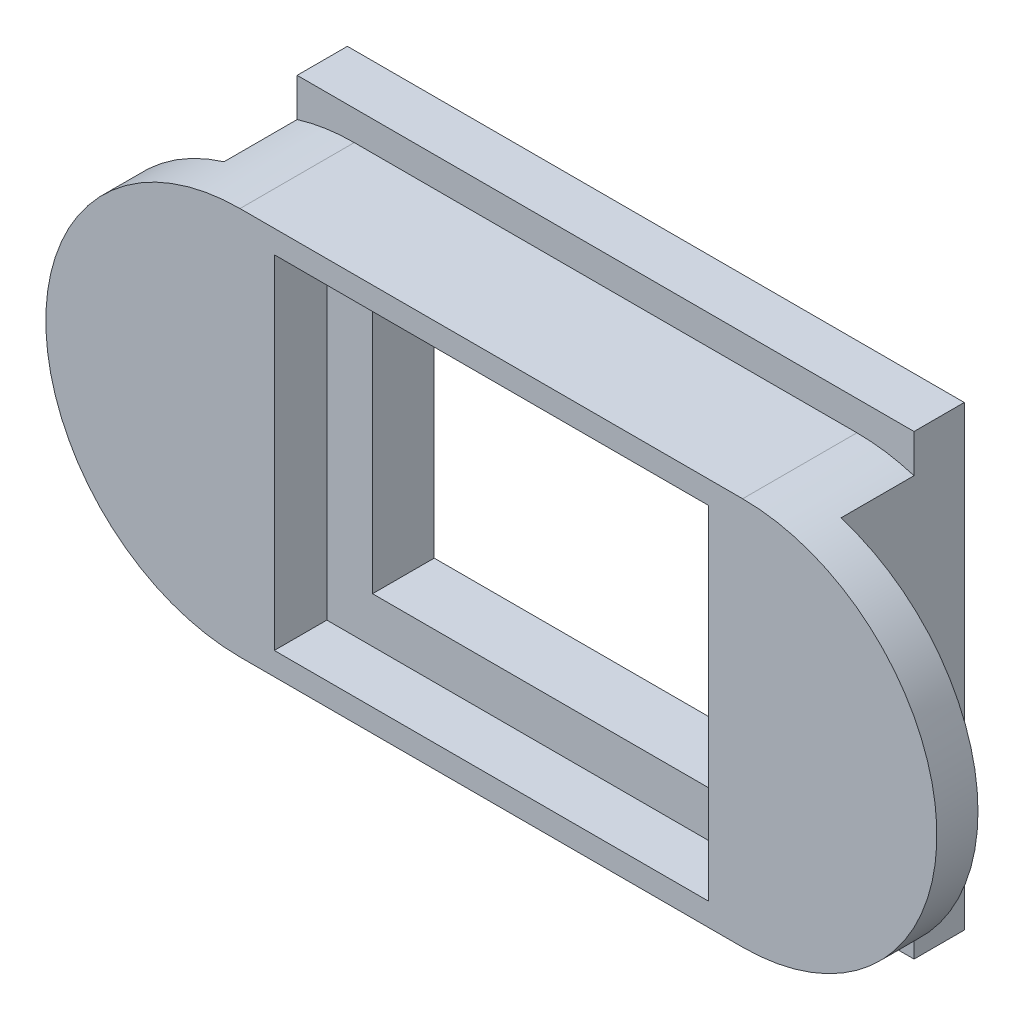
ISO-10303-21;
HEADER;
FILE_DESCRIPTION(('STEP AP214'),'2;1');
FILE_NAME('part.step','',(''),(''),'','','');
FILE_SCHEMA(('AUTOMOTIVE_DESIGN { 1 0 10303 214 1 1 1 1 }'));
ENDSEC;
DATA;
#1=APPLICATION_CONTEXT('core data for automotive mechanical design processes');
#2=APPLICATION_PROTOCOL_DEFINITION('international standard','automotive_design',2000,#1);
#3=PRODUCT_CONTEXT('',#1,'mechanical');
#4=PRODUCT('Part','Part','',(#3));
#5=PRODUCT_RELATED_PRODUCT_CATEGORY('part','',(#4));
#6=PRODUCT_DEFINITION_FORMATION('','',#4);
#7=PRODUCT_DEFINITION_CONTEXT('part definition',#1,'design');
#8=PRODUCT_DEFINITION('design','',#6,#7);
#9=PRODUCT_DEFINITION_SHAPE('','',#8);
#10=(LENGTH_UNIT() NAMED_UNIT(*) SI_UNIT(.MILLI.,.METRE.));
#11=(NAMED_UNIT(*) PLANE_ANGLE_UNIT() SI_UNIT($,.RADIAN.));
#12=(NAMED_UNIT(*) SI_UNIT($,.STERADIAN.) SOLID_ANGLE_UNIT());
#13=UNCERTAINTY_MEASURE_WITH_UNIT(LENGTH_MEASURE(1.E-05),#10,'distance_accuracy_value','');
#14=(GEOMETRIC_REPRESENTATION_CONTEXT(3) GLOBAL_UNCERTAINTY_ASSIGNED_CONTEXT((#13)) GLOBAL_UNIT_ASSIGNED_CONTEXT((#10,
#11,#12)) REPRESENTATION_CONTEXT('',''));
#15=CARTESIAN_POINT('',(0.,0.,0.));
#16=DIRECTION('',(0.,0.,1.));
#17=DIRECTION('',(1.,0.,0.));
#18=AXIS2_PLACEMENT_3D('',#15,#16,#17);
#19=CARTESIAN_POINT('',(-11.,0.,5.));
#20=DIRECTION('',(0.,0.,-1.));
#21=DIRECTION('',(-1.,0.,0.));
#22=AXIS2_PLACEMENT_3D('',#19,#20,#21);
#23=CYLINDRICAL_SURFACE('',#22,8.5);
#24=DIRECTION('',(0.,0.,-1.));
#25=VECTOR('',#24,1.);
#26=CARTESIAN_POINT('',(-13.5,8.12403840463596,5.));
#27=LINE('',#26,#25);
#28=CARTESIAN_POINT('',(-13.5,8.12403840463596,3.2));
#29=VERTEX_POINT('',#28);
#30=CARTESIAN_POINT('',(-13.5,8.12403840463596,0.));
#31=VERTEX_POINT('',#30);
#32=EDGE_CURVE('E13',#29,#31,#27,.T.);
#33=ORIENTED_EDGE('',*,*,#32,.F.);
#34=CARTESIAN_POINT('',(-11.,0.,3.2));
#35=DIRECTION('',(0.,0.,1.));
#36=DIRECTION('',(1.,0.,0.));
#37=AXIS2_PLACEMENT_3D('',#34,#35,#36);
#38=CIRCLE('',#37,8.5);
#39=CARTESIAN_POINT('',(-13.5,-8.12403840463596,3.2));
#40=VERTEX_POINT('',#39);
#41=EDGE_CURVE('E288',#29,#40,#38,.T.);
#42=ORIENTED_EDGE('',*,*,#41,.T.);
#43=DIRECTION('',(0.,0.,-1.));
#44=VECTOR('',#43,1.);
#45=CARTESIAN_POINT('',(-13.5,-8.12403840463596,5.));
#46=LINE('',#45,#44);
#47=CARTESIAN_POINT('',(-13.5,-8.12403840463596,0.));
#48=VERTEX_POINT('',#47);
#49=EDGE_CURVE('E44',#48,#40,#46,.F.);
#50=ORIENTED_EDGE('',*,*,#49,.F.);
#51=CARTESIAN_POINT('',(-11.,0.,0.));
#52=DIRECTION('',(0.,0.,1.));
#53=DIRECTION('',(1.,0.,0.));
#54=AXIS2_PLACEMENT_3D('',#51,#52,#53);
#55=CIRCLE('',#54,8.5);
#56=CARTESIAN_POINT('',(-11.,-8.5,0.));
#57=VERTEX_POINT('',#56);
#58=EDGE_CURVE('E215',#48,#57,#55,.T.);
#59=ORIENTED_EDGE('',*,*,#58,.T.);
#60=DIRECTION('',(0.,0.,-1.));
#61=VECTOR('',#60,1.);
#62=CARTESIAN_POINT('',(-11.,-8.5,5.));
#63=LINE('',#62,#61);
#64=CARTESIAN_POINT('',(-11.,-8.5,5.));
#65=VERTEX_POINT('',#64);
#66=EDGE_CURVE('E267',#65,#57,#63,.T.);
#67=ORIENTED_EDGE('',*,*,#66,.F.);
#68=CARTESIAN_POINT('',(-11.,0.,5.));
#69=DIRECTION('',(0.,0.,1.));
#70=DIRECTION('',(1.,0.,0.));
#71=AXIS2_PLACEMENT_3D('',#68,#69,#70);
#72=CIRCLE('',#71,8.5);
#73=CARTESIAN_POINT('',(-11.,8.5,5.));
#74=VERTEX_POINT('',#73);
#75=EDGE_CURVE('E236',#74,#65,#72,.T.);
#76=ORIENTED_EDGE('',*,*,#75,.F.);
#77=DIRECTION('',(0.,0.,-1.));
#78=VECTOR('',#77,1.);
#79=CARTESIAN_POINT('',(-11.,8.5,5.));
#80=LINE('',#79,#78);
#81=CARTESIAN_POINT('',(-11.,8.5,0.));
#82=VERTEX_POINT('',#81);
#83=EDGE_CURVE('E246',#74,#82,#80,.T.);
#84=ORIENTED_EDGE('',*,*,#83,.T.);
#85=EDGE_CURVE('E247',#82,#31,#55,.T.);
#86=ORIENTED_EDGE('',*,*,#85,.T.);
#87=EDGE_LOOP('',(#33,#42,#50,#59,#67,#76,#84,#86));
#88=FACE_BOUND('',#87,.T.);
#89=ADVANCED_FACE('F37',(#88),#23,.T.);
#90=CARTESIAN_POINT('',(11.,0.,5.));
#91=DIRECTION('',(0.,0.,-1.));
#92=DIRECTION('',(-1.,0.,0.));
#93=AXIS2_PLACEMENT_3D('',#90,#91,#92);
#94=CYLINDRICAL_SURFACE('',#93,8.5);
#95=DIRECTION('',(0.,0.,-1.));
#96=VECTOR('',#95,1.);
#97=CARTESIAN_POINT('',(13.5,-8.12403840463596,5.));
#98=LINE('',#97,#96);
#99=CARTESIAN_POINT('',(13.5,-8.12403840463596,3.2));
#100=VERTEX_POINT('',#99);
#101=CARTESIAN_POINT('',(13.5,-8.12403840463596,0.));
#102=VERTEX_POINT('',#101);
#103=EDGE_CURVE('E275',#100,#102,#98,.T.);
#104=ORIENTED_EDGE('',*,*,#103,.F.);
#105=CARTESIAN_POINT('',(11.,0.,3.2));
#106=DIRECTION('',(0.,0.,1.));
#107=DIRECTION('',(1.,0.,0.));
#108=AXIS2_PLACEMENT_3D('',#105,#106,#107);
#109=CIRCLE('',#108,8.5);
#110=CARTESIAN_POINT('',(13.5,8.12403840463596,3.2));
#111=VERTEX_POINT('',#110);
#112=EDGE_CURVE('E290',#100,#111,#109,.T.);
#113=ORIENTED_EDGE('',*,*,#112,.T.);
#114=DIRECTION('',(0.,0.,-1.));
#115=VECTOR('',#114,1.);
#116=CARTESIAN_POINT('',(13.5,8.12403840463596,5.));
#117=LINE('',#116,#115);
#118=CARTESIAN_POINT('',(13.5,8.12403840463596,0.));
#119=VERTEX_POINT('',#118);
#120=EDGE_CURVE('E272',#119,#111,#117,.F.);
#121=ORIENTED_EDGE('',*,*,#120,.F.);
#122=CARTESIAN_POINT('',(11.,0.,0.));
#123=DIRECTION('',(0.,0.,1.));
#124=DIRECTION('',(1.,0.,0.));
#125=AXIS2_PLACEMENT_3D('',#122,#123,#124);
#126=CIRCLE('',#125,8.5);
#127=CARTESIAN_POINT('',(11.,8.5,0.));
#128=VERTEX_POINT('',#127);
#129=EDGE_CURVE('E253',#119,#128,#126,.T.);
#130=ORIENTED_EDGE('',*,*,#129,.T.);
#131=DIRECTION('',(0.,0.,-1.));
#132=VECTOR('',#131,1.);
#133=CARTESIAN_POINT('',(11.,8.5,5.));
#134=LINE('',#133,#132);
#135=CARTESIAN_POINT('',(11.,8.5,5.));
#136=VERTEX_POINT('',#135);
#137=EDGE_CURVE('E261',#136,#128,#134,.T.);
#138=ORIENTED_EDGE('',*,*,#137,.F.);
#139=CARTESIAN_POINT('',(11.,0.,5.));
#140=DIRECTION('',(0.,0.,1.));
#141=DIRECTION('',(1.,0.,0.));
#142=AXIS2_PLACEMENT_3D('',#139,#140,#141);
#143=CIRCLE('',#142,8.5);
#144=CARTESIAN_POINT('',(11.,-8.49999999999999,5.));
#145=VERTEX_POINT('',#144);
#146=EDGE_CURVE('E242',#145,#136,#143,.T.);
#147=ORIENTED_EDGE('',*,*,#146,.F.);
#148=DIRECTION('',(0.,0.,-1.));
#149=VECTOR('',#148,1.);
#150=CARTESIAN_POINT('',(11.,-8.49999999999999,5.));
#151=LINE('',#150,#149);
#152=CARTESIAN_POINT('',(11.,-8.49999999999999,0.));
#153=VERTEX_POINT('',#152);
#154=EDGE_CURVE('E264',#145,#153,#151,.T.);
#155=ORIENTED_EDGE('',*,*,#154,.T.);
#156=EDGE_CURVE('E254',#153,#102,#126,.T.);
#157=ORIENTED_EDGE('',*,*,#156,.T.);
#158=EDGE_LOOP('',(#104,#113,#121,#130,#138,#147,#155,#157));
#159=FACE_BOUND('',#158,.T.);
#160=ADVANCED_FACE('F392',(#159),#94,.T.);
#161=CARTESIAN_POINT('',(-11.,0.,5.));
#162=DIRECTION('',(0.,0.,1.));
#163=DIRECTION('',(1.,0.,0.));
#164=AXIS2_PLACEMENT_3D('',#161,#162,#163);
#165=PLANE('',#164);
#166=DIRECTION('',(0.,1.,0.));
#167=VECTOR('',#166,1.);
#168=CARTESIAN_POINT('',(9.5,-7.5,5.));
#169=LINE('',#168,#167);
#170=CARTESIAN_POINT('',(9.5,-7.5,5.));
#171=VERTEX_POINT('',#170);
#172=CARTESIAN_POINT('',(9.5,7.5,5.));
#173=VERTEX_POINT('',#172);
#174=EDGE_CURVE('E289',#171,#173,#169,.T.);
#175=ORIENTED_EDGE('',*,*,#174,.F.);
#176=DIRECTION('',(1.,0.,0.));
#177=VECTOR('',#176,1.);
#178=CARTESIAN_POINT('',(-9.5,-7.5,5.));
#179=LINE('',#178,#177);
#180=CARTESIAN_POINT('',(-9.5,-7.5,5.));
#181=VERTEX_POINT('',#180);
#182=EDGE_CURVE('E302',#181,#171,#179,.T.);
#183=ORIENTED_EDGE('',*,*,#182,.F.);
#184=DIRECTION('',(0.,-1.,0.));
#185=VECTOR('',#184,1.);
#186=CARTESIAN_POINT('',(-9.5,-7.5,5.));
#187=LINE('',#186,#185);
#188=CARTESIAN_POINT('',(-9.5,7.5,5.));
#189=VERTEX_POINT('',#188);
#190=EDGE_CURVE('E314',#189,#181,#187,.T.);
#191=ORIENTED_EDGE('',*,*,#190,.F.);
#192=DIRECTION('',(-1.,0.,0.));
#193=VECTOR('',#192,1.);
#194=CARTESIAN_POINT('',(-9.5,7.5,5.));
#195=LINE('',#194,#193);
#196=EDGE_CURVE('E292',#173,#189,#195,.T.);
#197=ORIENTED_EDGE('',*,*,#196,.F.);
#198=EDGE_LOOP('',(#175,#183,#191,#197));
#199=FACE_BOUND('',#198,.T.);
#200=ORIENTED_EDGE('',*,*,#75,.T.);
#201=DIRECTION('',(1.,0.,0.));
#202=VECTOR('',#201,1.);
#203=CARTESIAN_POINT('',(-11.,-8.5,5.));
#204=LINE('',#203,#202);
#205=EDGE_CURVE('E239',#65,#145,#204,.T.);
#206=ORIENTED_EDGE('',*,*,#205,.T.);
#207=ORIENTED_EDGE('',*,*,#146,.T.);
#208=DIRECTION('',(-1.,0.,0.));
#209=VECTOR('',#208,1.);
#210=CARTESIAN_POINT('',(-11.,8.5,5.));
#211=LINE('',#210,#209);
#212=EDGE_CURVE('E244',#136,#74,#211,.T.);
#213=ORIENTED_EDGE('',*,*,#212,.T.);
#214=EDGE_LOOP('',(#200,#206,#207,#213));
#215=FACE_BOUND('',#214,.T.);
#216=ADVANCED_FACE('F423',(#199,#215),#165,.T.);
#217=CARTESIAN_POINT('',(-11.,-8.5,5.));
#218=DIRECTION('',(0.,1.,0.));
#219=DIRECTION('',(-1.,0.,0.));
#220=AXIS2_PLACEMENT_3D('',#217,#218,#219);
#221=PLANE('',#220);
#222=ORIENTED_EDGE('',*,*,#66,.T.);
#223=DIRECTION('',(1.,0.,0.));
#224=VECTOR('',#223,1.);
#225=CARTESIAN_POINT('',(-11.,-8.5,0.));
#226=LINE('',#225,#224);
#227=EDGE_CURVE('E250',#57,#153,#226,.T.);
#228=ORIENTED_EDGE('',*,*,#227,.T.);
#229=ORIENTED_EDGE('',*,*,#154,.F.);
#230=ORIENTED_EDGE('',*,*,#205,.F.);
#231=EDGE_LOOP('',(#222,#228,#229,#230));
#232=FACE_BOUND('',#231,.T.);
#233=ADVANCED_FACE('F426',(#232),#221,.F.);
#234=CARTESIAN_POINT('',(-11.,8.5,5.));
#235=DIRECTION('',(0.,-1.,0.));
#236=DIRECTION('',(1.,0.,0.));
#237=AXIS2_PLACEMENT_3D('',#234,#235,#236);
#238=PLANE('',#237);
#239=ORIENTED_EDGE('',*,*,#137,.T.);
#240=DIRECTION('',(-1.,0.,0.));
#241=VECTOR('',#240,1.);
#242=CARTESIAN_POINT('',(-11.,8.5,0.));
#243=LINE('',#242,#241);
#244=EDGE_CURVE('E240',#128,#82,#243,.T.);
#245=ORIENTED_EDGE('',*,*,#244,.T.);
#246=ORIENTED_EDGE('',*,*,#83,.F.);
#247=ORIENTED_EDGE('',*,*,#212,.F.);
#248=EDGE_LOOP('',(#239,#245,#246,#247));
#249=FACE_BOUND('',#248,.T.);
#250=ADVANCED_FACE('F420',(#249),#238,.F.);
#251=CARTESIAN_POINT('',(7.5,-5.5,5.));
#252=DIRECTION('',(-1.,0.,0.));
#253=DIRECTION('',(0.,0.,1.));
#254=AXIS2_PLACEMENT_3D('',#251,#252,#253);
#255=PLANE('',#254);
#256=DIRECTION('',(0.,-1.,0.));
#257=VECTOR('',#256,1.);
#258=CARTESIAN_POINT('',(7.5,-5.5,2.7));
#259=LINE('',#258,#257);
#260=CARTESIAN_POINT('',(7.5,5.5,2.7));
#261=VERTEX_POINT('',#260);
#262=CARTESIAN_POINT('',(7.5,-5.5,2.7));
#263=VERTEX_POINT('',#262);
#264=EDGE_CURVE('E207',#261,#263,#259,.T.);
#265=ORIENTED_EDGE('',*,*,#264,.F.);
#266=DIRECTION('',(0.,0.,-1.));
#267=VECTOR('',#266,1.);
#268=CARTESIAN_POINT('',(7.5,5.5,5.));
#269=LINE('',#268,#267);
#270=CARTESIAN_POINT('',(7.5,5.5,0.));
#271=VERTEX_POINT('',#270);
#272=EDGE_CURVE('E211',#261,#271,#269,.T.);
#273=ORIENTED_EDGE('',*,*,#272,.T.);
#274=DIRECTION('',(0.,1.,0.));
#275=VECTOR('',#274,1.);
#276=CARTESIAN_POINT('',(7.5,-5.5,0.));
#277=LINE('',#276,#275);
#278=CARTESIAN_POINT('',(7.5,-5.5,0.));
#279=VERTEX_POINT('',#278);
#280=EDGE_CURVE('E199',#279,#271,#277,.T.);
#281=ORIENTED_EDGE('',*,*,#280,.F.);
#282=DIRECTION('',(0.,0.,-1.));
#283=VECTOR('',#282,1.);
#284=CARTESIAN_POINT('',(7.5,-5.5,5.));
#285=LINE('',#284,#283);
#286=EDGE_CURVE('E230',#263,#279,#285,.T.);
#287=ORIENTED_EDGE('',*,*,#286,.F.);
#288=EDGE_LOOP('',(#265,#273,#281,#287));
#289=FACE_BOUND('',#288,.T.);
#290=ADVANCED_FACE('F212',(#289),#255,.T.);
#291=CARTESIAN_POINT('',(-7.5,5.5,5.));
#292=DIRECTION('',(0.,-1.,0.));
#293=DIRECTION('',(0.,0.,-1.));
#294=AXIS2_PLACEMENT_3D('',#291,#292,#293);
#295=PLANE('',#294);
#296=DIRECTION('',(1.,0.,0.));
#297=VECTOR('',#296,1.);
#298=CARTESIAN_POINT('',(-7.5,5.5,2.7));
#299=LINE('',#298,#297);
#300=CARTESIAN_POINT('',(-7.5,5.5,2.7));
#301=VERTEX_POINT('',#300);
#302=EDGE_CURVE('E329',#301,#261,#299,.T.);
#303=ORIENTED_EDGE('',*,*,#302,.F.);
#304=DIRECTION('',(0.,0.,-1.));
#305=VECTOR('',#304,1.);
#306=CARTESIAN_POINT('',(-7.5,5.5,5.));
#307=LINE('',#306,#305);
#308=CARTESIAN_POINT('',(-7.5,5.5,0.));
#309=VERTEX_POINT('',#308);
#310=EDGE_CURVE('E216',#301,#309,#307,.T.);
#311=ORIENTED_EDGE('',*,*,#310,.T.);
#312=DIRECTION('',(-1.,0.,0.));
#313=VECTOR('',#312,1.);
#314=CARTESIAN_POINT('',(-7.5,5.5,0.));
#315=LINE('',#314,#313);
#316=EDGE_CURVE('E189',#271,#309,#315,.T.);
#317=ORIENTED_EDGE('',*,*,#316,.F.);
#318=ORIENTED_EDGE('',*,*,#272,.F.);
#319=EDGE_LOOP('',(#303,#311,#317,#318));
#320=FACE_BOUND('',#319,.T.);
#321=ADVANCED_FACE('F219',(#320),#295,.T.);
#322=CARTESIAN_POINT('',(-7.5,-5.5,5.));
#323=DIRECTION('',(1.,0.,0.));
#324=DIRECTION('',(0.,0.,-1.));
#325=AXIS2_PLACEMENT_3D('',#322,#323,#324);
#326=PLANE('',#325);
#327=DIRECTION('',(0.,1.,0.));
#328=VECTOR('',#327,1.);
#329=CARTESIAN_POINT('',(-7.5,-5.5,2.7));
#330=LINE('',#329,#328);
#331=CARTESIAN_POINT('',(-7.5,-5.5,2.7));
#332=VERTEX_POINT('',#331);
#333=EDGE_CURVE('E321',#332,#301,#330,.T.);
#334=ORIENTED_EDGE('',*,*,#333,.F.);
#335=DIRECTION('',(0.,0.,-1.));
#336=VECTOR('',#335,1.);
#337=CARTESIAN_POINT('',(-7.5,-5.5,5.));
#338=LINE('',#337,#336);
#339=CARTESIAN_POINT('',(-7.5,-5.5,0.));
#340=VERTEX_POINT('',#339);
#341=EDGE_CURVE('E232',#332,#340,#338,.T.);
#342=ORIENTED_EDGE('',*,*,#341,.T.);
#343=DIRECTION('',(0.,-1.,0.));
#344=VECTOR('',#343,1.);
#345=CARTESIAN_POINT('',(-7.5,-5.5,0.));
#346=LINE('',#345,#344);
#347=EDGE_CURVE('E222',#309,#340,#346,.T.);
#348=ORIENTED_EDGE('',*,*,#347,.F.);
#349=ORIENTED_EDGE('',*,*,#310,.F.);
#350=EDGE_LOOP('',(#334,#342,#348,#349));
#351=FACE_BOUND('',#350,.T.);
#352=ADVANCED_FACE('F340',(#351),#326,.T.);
#353=CARTESIAN_POINT('',(-7.5,-5.5,5.));
#354=DIRECTION('',(0.,1.,0.));
#355=DIRECTION('',(0.,0.,1.));
#356=AXIS2_PLACEMENT_3D('',#353,#354,#355);
#357=PLANE('',#356);
#358=DIRECTION('',(-1.,0.,0.));
#359=VECTOR('',#358,1.);
#360=CARTESIAN_POINT('',(-7.5,-5.5,2.7));
#361=LINE('',#360,#359);
#362=EDGE_CURVE('E270',#263,#332,#361,.T.);
#363=ORIENTED_EDGE('',*,*,#362,.F.);
#364=ORIENTED_EDGE('',*,*,#286,.T.);
#365=DIRECTION('',(1.,0.,0.));
#366=VECTOR('',#365,1.);
#367=CARTESIAN_POINT('',(-7.5,-5.5,0.));
#368=LINE('',#367,#366);
#369=EDGE_CURVE('E225',#340,#279,#368,.T.);
#370=ORIENTED_EDGE('',*,*,#369,.F.);
#371=ORIENTED_EDGE('',*,*,#341,.F.);
#372=EDGE_LOOP('',(#363,#364,#370,#371));
#373=FACE_BOUND('',#372,.T.);
#374=ADVANCED_FACE('F337',(#373),#357,.T.);
#375=CARTESIAN_POINT('',(9.5,-7.5,2.7));
#376=DIRECTION('',(1.,0.,0.));
#377=DIRECTION('',(0.,0.,-1.));
#378=AXIS2_PLACEMENT_3D('',#375,#376,#377);
#379=PLANE('',#378);
#380=ORIENTED_EDGE('',*,*,#174,.T.);
#381=DIRECTION('',(0.,0.,1.));
#382=VECTOR('',#381,1.);
#383=CARTESIAN_POINT('',(9.5,7.5,2.7));
#384=LINE('',#383,#382);
#385=CARTESIAN_POINT('',(9.5,7.5,2.7));
#386=VERTEX_POINT('',#385);
#387=EDGE_CURVE('E310',#386,#173,#384,.T.);
#388=ORIENTED_EDGE('',*,*,#387,.F.);
#389=DIRECTION('',(0.,1.,0.));
#390=VECTOR('',#389,1.);
#391=CARTESIAN_POINT('',(9.5,-7.5,2.7));
#392=LINE('',#391,#390);
#393=CARTESIAN_POINT('',(9.5,-7.5,2.7));
#394=VERTEX_POINT('',#393);
#395=EDGE_CURVE('E298',#394,#386,#392,.T.);
#396=ORIENTED_EDGE('',*,*,#395,.F.);
#397=DIRECTION('',(0.,0.,1.));
#398=VECTOR('',#397,1.);
#399=CARTESIAN_POINT('',(9.5,-7.5,2.7));
#400=LINE('',#399,#398);
#401=EDGE_CURVE('E319',#394,#171,#400,.T.);
#402=ORIENTED_EDGE('',*,*,#401,.T.);
#403=EDGE_LOOP('',(#380,#388,#396,#402));
#404=FACE_BOUND('',#403,.T.);
#405=ADVANCED_FACE('F451',(#404),#379,.F.);
#406=CARTESIAN_POINT('',(-9.5,-7.5,2.7));
#407=DIRECTION('',(0.,-1.,0.));
#408=DIRECTION('',(0.,0.,-1.));
#409=AXIS2_PLACEMENT_3D('',#406,#407,#408);
#410=PLANE('',#409);
#411=ORIENTED_EDGE('',*,*,#182,.T.);
#412=ORIENTED_EDGE('',*,*,#401,.F.);
#413=DIRECTION('',(1.,0.,0.));
#414=VECTOR('',#413,1.);
#415=CARTESIAN_POINT('',(-9.5,-7.5,2.7));
#416=LINE('',#415,#414);
#417=CARTESIAN_POINT('',(-9.5,-7.5,2.7));
#418=VERTEX_POINT('',#417);
#419=EDGE_CURVE('E308',#418,#394,#416,.T.);
#420=ORIENTED_EDGE('',*,*,#419,.F.);
#421=DIRECTION('',(0.,0.,1.));
#422=VECTOR('',#421,1.);
#423=CARTESIAN_POINT('',(-9.5,-7.5,2.7));
#424=LINE('',#423,#422);
#425=EDGE_CURVE('E322',#418,#181,#424,.T.);
#426=ORIENTED_EDGE('',*,*,#425,.T.);
#427=EDGE_LOOP('',(#411,#412,#420,#426));
#428=FACE_BOUND('',#427,.T.);
#429=ADVANCED_FACE('F454',(#428),#410,.F.);
#430=CARTESIAN_POINT('',(-9.5,-7.5,2.7));
#431=DIRECTION('',(-1.,0.,0.));
#432=DIRECTION('',(0.,0.,1.));
#433=AXIS2_PLACEMENT_3D('',#430,#431,#432);
#434=PLANE('',#433);
#435=ORIENTED_EDGE('',*,*,#190,.T.);
#436=ORIENTED_EDGE('',*,*,#425,.F.);
#437=DIRECTION('',(0.,-1.,0.));
#438=VECTOR('',#437,1.);
#439=CARTESIAN_POINT('',(-9.5,-7.5,2.7));
#440=LINE('',#439,#438);
#441=CARTESIAN_POINT('',(-9.5,7.5,2.7));
#442=VERTEX_POINT('',#441);
#443=EDGE_CURVE('E305',#442,#418,#440,.T.);
#444=ORIENTED_EDGE('',*,*,#443,.F.);
#445=DIRECTION('',(0.,0.,1.));
#446=VECTOR('',#445,1.);
#447=CARTESIAN_POINT('',(-9.5,7.5,2.7));
#448=LINE('',#447,#446);
#449=EDGE_CURVE('E324',#442,#189,#448,.T.);
#450=ORIENTED_EDGE('',*,*,#449,.T.);
#451=EDGE_LOOP('',(#435,#436,#444,#450));
#452=FACE_BOUND('',#451,.T.);
#453=ADVANCED_FACE('F459',(#452),#434,.F.);
#454=CARTESIAN_POINT('',(-9.5,7.5,2.7));
#455=DIRECTION('',(0.,1.,0.));
#456=DIRECTION('',(0.,0.,1.));
#457=AXIS2_PLACEMENT_3D('',#454,#455,#456);
#458=PLANE('',#457);
#459=ORIENTED_EDGE('',*,*,#196,.T.);
#460=ORIENTED_EDGE('',*,*,#449,.F.);
#461=DIRECTION('',(-1.,0.,0.));
#462=VECTOR('',#461,1.);
#463=CARTESIAN_POINT('',(-9.5,7.5,2.7));
#464=LINE('',#463,#462);
#465=EDGE_CURVE('E301',#386,#442,#464,.T.);
#466=ORIENTED_EDGE('',*,*,#465,.F.);
#467=ORIENTED_EDGE('',*,*,#387,.T.);
#468=EDGE_LOOP('',(#459,#460,#466,#467));
#469=FACE_BOUND('',#468,.T.);
#470=ADVANCED_FACE('F456',(#469),#458,.F.);
#471=CARTESIAN_POINT('',(0.,0.,2.7));
#472=DIRECTION('',(0.,0.,-1.));
#473=DIRECTION('',(-1.,0.,0.));
#474=AXIS2_PLACEMENT_3D('',#471,#472,#473);
#475=PLANE('',#474);
#476=ORIENTED_EDGE('',*,*,#264,.T.);
#477=ORIENTED_EDGE('',*,*,#362,.T.);
#478=ORIENTED_EDGE('',*,*,#333,.T.);
#479=ORIENTED_EDGE('',*,*,#302,.T.);
#480=EDGE_LOOP('',(#476,#477,#478,#479));
#481=FACE_BOUND('',#480,.T.);
#482=ORIENTED_EDGE('',*,*,#395,.T.);
#483=ORIENTED_EDGE('',*,*,#465,.T.);
#484=ORIENTED_EDGE('',*,*,#443,.T.);
#485=ORIENTED_EDGE('',*,*,#419,.T.);
#486=EDGE_LOOP('',(#482,#483,#484,#485));
#487=FACE_BOUND('',#486,.T.);
#488=ADVANCED_FACE('F332',(#481,#487),#475,.F.);
#489=CARTESIAN_POINT('',(-11.,0.,3.2));
#490=DIRECTION('',(0.,0.,1.));
#491=DIRECTION('',(1.,0.,0.));
#492=AXIS2_PLACEMENT_3D('',#489,#490,#491);
#493=PLANE('',#492);
#494=DIRECTION('',(0.,-1.,0.));
#495=VECTOR('',#494,1.);
#496=CARTESIAN_POINT('',(13.5,8.5,3.2));
#497=LINE('',#496,#495);
#498=EDGE_CURVE('E384',#111,#100,#497,.T.);
#499=ORIENTED_EDGE('',*,*,#498,.F.);
#500=ORIENTED_EDGE('',*,*,#112,.F.);
#501=EDGE_LOOP('',(#499,#500));
#502=FACE_BOUND('',#501,.T.);
#503=ADVANCED_FACE('F469',(#502),#493,.F.);
#504=CARTESIAN_POINT('',(13.5,8.5,48.2016872565222));
#505=DIRECTION('',(1.,0.,0.));
#506=DIRECTION('',(0.,0.,-1.));
#507=AXIS2_PLACEMENT_3D('',#504,#505,#506);
#508=PLANE('',#507);
#509=ORIENTED_EDGE('',*,*,#103,.T.);
#510=DIRECTION('',(0.,-1.,0.));
#511=VECTOR('',#510,1.);
#512=CARTESIAN_POINT('',(13.5,9.8,0.));
#513=LINE('',#512,#511);
#514=CARTESIAN_POINT('',(13.5,-10.2,0.));
#515=VERTEX_POINT('',#514);
#516=EDGE_CURVE('E369',#102,#515,#513,.T.);
#517=ORIENTED_EDGE('',*,*,#516,.T.);
#518=DIRECTION('',(0.,0.,1.));
#519=VECTOR('',#518,1.);
#520=CARTESIAN_POINT('',(13.5,-10.2,-2.2));
#521=LINE('',#520,#519);
#522=CARTESIAN_POINT('',(13.5,-10.2,-2.2));
#523=VERTEX_POINT('',#522);
#524=EDGE_CURVE('E381',#523,#515,#521,.T.);
#525=ORIENTED_EDGE('',*,*,#524,.F.);
#526=DIRECTION('',(0.,-1.,0.));
#527=VECTOR('',#526,1.);
#528=CARTESIAN_POINT('',(13.5,9.8,-2.2));
#529=LINE('',#528,#527);
#530=CARTESIAN_POINT('',(13.5,9.8,-2.2));
#531=VERTEX_POINT('',#530);
#532=EDGE_CURVE('E354',#531,#523,#529,.T.);
#533=ORIENTED_EDGE('',*,*,#532,.F.);
#534=DIRECTION('',(0.,0.,1.));
#535=VECTOR('',#534,1.);
#536=CARTESIAN_POINT('',(13.5,9.8,-2.2));
#537=LINE('',#536,#535);
#538=CARTESIAN_POINT('',(13.5,9.8,0.));
#539=VERTEX_POINT('',#538);
#540=EDGE_CURVE('E364',#531,#539,#537,.T.);
#541=ORIENTED_EDGE('',*,*,#540,.T.);
#542=EDGE_CURVE('E365',#539,#119,#513,.T.);
#543=ORIENTED_EDGE('',*,*,#542,.T.);
#544=ORIENTED_EDGE('',*,*,#120,.T.);
#545=ORIENTED_EDGE('',*,*,#498,.T.);
#546=EDGE_LOOP('',(#509,#517,#525,#533,#541,#543,#544,#545));
#547=FACE_BOUND('',#546,.T.);
#548=ADVANCED_FACE('F388',(#547),#508,.T.);
#549=CARTESIAN_POINT('',(-13.5,8.5,48.2016872565222));
#550=DIRECTION('',(-1.,0.,0.));
#551=DIRECTION('',(0.,0.,1.));
#552=AXIS2_PLACEMENT_3D('',#549,#550,#551);
#553=PLANE('',#552);
#554=ORIENTED_EDGE('',*,*,#32,.T.);
#555=DIRECTION('',(0.,1.,0.));
#556=VECTOR('',#555,1.);
#557=CARTESIAN_POINT('',(-13.5,9.8,0.));
#558=LINE('',#557,#556);
#559=CARTESIAN_POINT('',(-13.5,9.8,0.));
#560=VERTEX_POINT('',#559);
#561=EDGE_CURVE('E371',#31,#560,#558,.T.);
#562=ORIENTED_EDGE('',*,*,#561,.T.);
#563=DIRECTION('',(0.,0.,1.));
#564=VECTOR('',#563,1.);
#565=CARTESIAN_POINT('',(-13.5,9.8,-2.2));
#566=LINE('',#565,#564);
#567=CARTESIAN_POINT('',(-13.5,9.8,-2.2));
#568=VERTEX_POINT('',#567);
#569=EDGE_CURVE('E376',#568,#560,#566,.T.);
#570=ORIENTED_EDGE('',*,*,#569,.F.);
#571=DIRECTION('',(0.,1.,0.));
#572=VECTOR('',#571,1.);
#573=CARTESIAN_POINT('',(-13.5,9.8,-2.2));
#574=LINE('',#573,#572);
#575=CARTESIAN_POINT('',(-13.5,-10.2,-2.2));
#576=VERTEX_POINT('',#575);
#577=EDGE_CURVE('E360',#576,#568,#574,.T.);
#578=ORIENTED_EDGE('',*,*,#577,.F.);
#579=DIRECTION('',(0.,0.,1.));
#580=VECTOR('',#579,1.);
#581=CARTESIAN_POINT('',(-13.5,-10.2,-2.2));
#582=LINE('',#581,#580);
#583=CARTESIAN_POINT('',(-13.5,-10.2,0.));
#584=VERTEX_POINT('',#583);
#585=EDGE_CURVE('E379',#576,#584,#582,.T.);
#586=ORIENTED_EDGE('',*,*,#585,.T.);
#587=EDGE_CURVE('E285',#584,#48,#558,.T.);
#588=ORIENTED_EDGE('',*,*,#587,.T.);
#589=ORIENTED_EDGE('',*,*,#49,.T.);
#590=DIRECTION('',(0.,1.,0.));
#591=VECTOR('',#590,1.);
#592=CARTESIAN_POINT('',(-13.5,8.5,3.2));
#593=LINE('',#592,#591);
#594=EDGE_CURVE('E58',#40,#29,#593,.T.);
#595=ORIENTED_EDGE('',*,*,#594,.T.);
#596=EDGE_LOOP('',(#554,#562,#570,#578,#586,#588,#589,#595));
#597=FACE_BOUND('',#596,.T.);
#598=ADVANCED_FACE('F281',(#597),#553,.T.);
#599=ORIENTED_EDGE('',*,*,#594,.F.);
#600=ORIENTED_EDGE('',*,*,#41,.F.);
#601=EDGE_LOOP('',(#599,#600));
#602=FACE_BOUND('',#601,.T.);
#603=ADVANCED_FACE('F470',(#602),#493,.F.);
#604=CARTESIAN_POINT('',(0.,0.,0.));
#605=DIRECTION('',(0.,0.,-1.));
#606=DIRECTION('',(-1.,0.,0.));
#607=AXIS2_PLACEMENT_3D('',#604,#605,#606);
#608=PLANE('',#607);
#609=ORIENTED_EDGE('',*,*,#85,.F.);
#610=ORIENTED_EDGE('',*,*,#244,.F.);
#611=ORIENTED_EDGE('',*,*,#129,.F.);
#612=ORIENTED_EDGE('',*,*,#542,.F.);
#613=DIRECTION('',(1.,0.,0.));
#614=VECTOR('',#613,1.);
#615=CARTESIAN_POINT('',(13.5,9.8,0.));
#616=LINE('',#615,#614);
#617=EDGE_CURVE('E358',#560,#539,#616,.T.);
#618=ORIENTED_EDGE('',*,*,#617,.F.);
#619=ORIENTED_EDGE('',*,*,#561,.F.);
#620=EDGE_LOOP('',(#609,#610,#611,#612,#618,#619));
#621=FACE_BOUND('',#620,.T.);
#622=ADVANCED_FACE('F414',(#621),#608,.F.);
#623=CARTESIAN_POINT('',(0.,0.,-2.2));
#624=DIRECTION('',(0.,0.,-1.));
#625=DIRECTION('',(-1.,0.,0.));
#626=AXIS2_PLACEMENT_3D('',#623,#624,#625);
#627=PLANE('',#626);
#628=DIRECTION('',(0.,1.,0.));
#629=VECTOR('',#628,1.);
#630=CARTESIAN_POINT('',(10.8877029203921,0.,-2.2));
#631=LINE('',#630,#629);
#632=CARTESIAN_POINT('',(10.8877029203921,-8.88770292039209,-2.2));
#633=VERTEX_POINT('',#632);
#634=CARTESIAN_POINT('',(10.8877029203921,8.88770292039209,-2.2));
#635=VERTEX_POINT('',#634);
#636=EDGE_CURVE('E348',#633,#635,#631,.T.);
#637=ORIENTED_EDGE('',*,*,#636,.T.);
#638=DIRECTION('',(-1.,0.,0.));
#639=VECTOR('',#638,1.);
#640=CARTESIAN_POINT('',(0.,8.88770292039209,-2.2));
#641=LINE('',#640,#639);
#642=CARTESIAN_POINT('',(-10.8877029203921,8.88770292039209,-2.2));
#643=VERTEX_POINT('',#642);
#644=EDGE_CURVE('E191',#635,#643,#641,.T.);
#645=ORIENTED_EDGE('',*,*,#644,.T.);
#646=DIRECTION('',(0.,-1.,0.));
#647=VECTOR('',#646,1.);
#648=CARTESIAN_POINT('',(-10.8877029203921,0.,-2.2));
#649=LINE('',#648,#647);
#650=CARTESIAN_POINT('',(-10.8877029203921,-8.88770292039209,-2.2));
#651=VERTEX_POINT('',#650);
#652=EDGE_CURVE('E51',#643,#651,#649,.T.);
#653=ORIENTED_EDGE('',*,*,#652,.T.);
#654=DIRECTION('',(1.,0.,0.));
#655=VECTOR('',#654,1.);
#656=CARTESIAN_POINT('',(0.,-8.88770292039209,-2.2));
#657=LINE('',#656,#655);
#658=EDGE_CURVE('E196',#651,#633,#657,.T.);
#659=ORIENTED_EDGE('',*,*,#658,.T.);
#660=EDGE_LOOP('',(#637,#645,#653,#659));
#661=FACE_BOUND('',#660,.T.);
#662=ORIENTED_EDGE('',*,*,#532,.T.);
#663=DIRECTION('',(-1.,0.,0.));
#664=VECTOR('',#663,1.);
#665=CARTESIAN_POINT('',(13.5,-10.2,-2.2));
#666=LINE('',#665,#664);
#667=EDGE_CURVE('E357',#523,#576,#666,.T.);
#668=ORIENTED_EDGE('',*,*,#667,.T.);
#669=ORIENTED_EDGE('',*,*,#577,.T.);
#670=DIRECTION('',(1.,0.,0.));
#671=VECTOR('',#670,1.);
#672=CARTESIAN_POINT('',(13.5,9.8,-2.2));
#673=LINE('',#672,#671);
#674=EDGE_CURVE('E362',#568,#531,#673,.T.);
#675=ORIENTED_EDGE('',*,*,#674,.T.);
#676=EDGE_LOOP('',(#662,#668,#669,#675));
#677=FACE_BOUND('',#676,.T.);
#678=ADVANCED_FACE('F405',(#661,#677),#627,.T.);
#679=CARTESIAN_POINT('',(13.5,9.8,-2.2));
#680=DIRECTION('',(0.,-1.,0.));
#681=DIRECTION('',(0.,0.,-1.));
#682=AXIS2_PLACEMENT_3D('',#679,#680,#681);
#683=PLANE('',#682);
#684=ORIENTED_EDGE('',*,*,#617,.T.);
#685=ORIENTED_EDGE('',*,*,#540,.F.);
#686=ORIENTED_EDGE('',*,*,#674,.F.);
#687=ORIENTED_EDGE('',*,*,#569,.T.);
#688=EDGE_LOOP('',(#684,#685,#686,#687));
#689=FACE_BOUND('',#688,.T.);
#690=ADVANCED_FACE('F410',(#689),#683,.F.);
#691=CARTESIAN_POINT('',(13.5,-10.2,-2.2));
#692=DIRECTION('',(0.,1.,0.));
#693=DIRECTION('',(0.,0.,1.));
#694=AXIS2_PLACEMENT_3D('',#691,#692,#693);
#695=PLANE('',#694);
#696=DIRECTION('',(-1.,0.,0.));
#697=VECTOR('',#696,1.);
#698=CARTESIAN_POINT('',(13.5,-10.2,0.));
#699=LINE('',#698,#697);
#700=EDGE_CURVE('E368',#515,#584,#699,.T.);
#701=ORIENTED_EDGE('',*,*,#700,.T.);
#702=ORIENTED_EDGE('',*,*,#585,.F.);
#703=ORIENTED_EDGE('',*,*,#667,.F.);
#704=ORIENTED_EDGE('',*,*,#524,.T.);
#705=EDGE_LOOP('',(#701,#702,#703,#704));
#706=FACE_BOUND('',#705,.T.);
#707=ADVANCED_FACE('F401',(#706),#695,.F.);
#708=ORIENTED_EDGE('',*,*,#156,.F.);
#709=ORIENTED_EDGE('',*,*,#227,.F.);
#710=ORIENTED_EDGE('',*,*,#58,.F.);
#711=ORIENTED_EDGE('',*,*,#587,.F.);
#712=ORIENTED_EDGE('',*,*,#700,.F.);
#713=ORIENTED_EDGE('',*,*,#516,.F.);
#714=EDGE_LOOP('',(#708,#709,#710,#711,#712,#713));
#715=FACE_BOUND('',#714,.T.);
#716=ADVANCED_FACE('F396',(#715),#608,.F.);
#717=CARTESIAN_POINT('',(7.5,-5.5,0.));
#718=DIRECTION('',(0.544639035015026,0.,0.838670567945425));
#719=DIRECTION('',(0.838670567945425,0.,-0.544639035015026));
#720=AXIS2_PLACEMENT_3D('',#717,#718,#719);
#721=PLANE('',#720);
#722=ORIENTED_EDGE('',*,*,#280,.T.);
#723=DIRECTION('',(-0.642594670326267,-0.642594670326267,0.417305858258128));
#724=VECTOR('',#723,1.);
#725=CARTESIAN_POINT('',(2.95779298635104,0.95779298635104,2.94974372453862));
#726=LINE('',#725,#724);
#727=EDGE_CURVE('E185',#635,#271,#726,.T.);
#728=ORIENTED_EDGE('',*,*,#727,.F.);
#729=ORIENTED_EDGE('',*,*,#636,.F.);
#730=DIRECTION('',(-0.642594670326267,0.642594670326267,0.417305858258128));
#731=VECTOR('',#730,1.);
#732=CARTESIAN_POINT('',(1.30608134502415,0.693918654975853,4.02237780618902));
#733=LINE('',#732,#731);
#734=EDGE_CURVE('E202',#633,#279,#733,.T.);
#735=ORIENTED_EDGE('',*,*,#734,.T.);
#736=EDGE_LOOP('',(#722,#728,#729,#735));
#737=FACE_BOUND('',#736,.T.);
#738=ADVANCED_FACE('F201',(#737),#721,.F.);
#739=CARTESIAN_POINT('',(-7.5,-5.5,0.));
#740=DIRECTION('',(0.,-0.544639035015026,0.838670567945425));
#741=DIRECTION('',(0.,-0.838670567945425,-0.544639035015026));
#742=AXIS2_PLACEMENT_3D('',#739,#740,#741);
#743=PLANE('',#742);
#744=ORIENTED_EDGE('',*,*,#369,.T.);
#745=ORIENTED_EDGE('',*,*,#734,.F.);
#746=ORIENTED_EDGE('',*,*,#658,.F.);
#747=DIRECTION('',(0.642594670326267,0.642594670326267,0.417305858258128));
#748=VECTOR('',#747,1.);
#749=CARTESIAN_POINT('',(-2.95779298635104,-0.957792986351038,2.94974372453862));
#750=LINE('',#749,#748);
#751=EDGE_CURVE('E342',#651,#340,#750,.T.);
#752=ORIENTED_EDGE('',*,*,#751,.T.);
#753=EDGE_LOOP('',(#744,#745,#746,#752));
#754=FACE_BOUND('',#753,.T.);
#755=ADVANCED_FACE('F486',(#754),#743,.F.);
#756=CARTESIAN_POINT('',(-7.5,5.5,0.));
#757=DIRECTION('',(-0.544639035015026,0.,0.838670567945425));
#758=DIRECTION('',(0.838670567945425,0.,0.544639035015026));
#759=AXIS2_PLACEMENT_3D('',#756,#757,#758);
#760=PLANE('',#759);
#761=ORIENTED_EDGE('',*,*,#347,.T.);
#762=ORIENTED_EDGE('',*,*,#751,.F.);
#763=ORIENTED_EDGE('',*,*,#652,.F.);
#764=DIRECTION('',(0.642594670326267,-0.642594670326267,0.417305858258128));
#765=VECTOR('',#764,1.);
#766=CARTESIAN_POINT('',(-1.30608134502414,-0.693918654975855,4.02237780618902));
#767=LINE('',#766,#765);
#768=EDGE_CURVE('E195',#643,#309,#767,.T.);
#769=ORIENTED_EDGE('',*,*,#768,.T.);
#770=EDGE_LOOP('',(#761,#762,#763,#769));
#771=FACE_BOUND('',#770,.T.);
#772=ADVANCED_FACE('F341',(#771),#760,.F.);
#773=CARTESIAN_POINT('',(7.5,5.5,0.));
#774=DIRECTION('',(0.,0.544639035015026,0.838670567945425));
#775=DIRECTION('',(0.,-0.838670567945425,0.544639035015026));
#776=AXIS2_PLACEMENT_3D('',#773,#774,#775);
#777=PLANE('',#776);
#778=ORIENTED_EDGE('',*,*,#316,.T.);
#779=ORIENTED_EDGE('',*,*,#768,.F.);
#780=ORIENTED_EDGE('',*,*,#644,.F.);
#781=ORIENTED_EDGE('',*,*,#727,.T.);
#782=EDGE_LOOP('',(#778,#779,#780,#781));
#783=FACE_BOUND('',#782,.T.);
#784=ADVANCED_FACE('F187',(#783),#777,.F.);
#785=CLOSED_SHELL('',(#89,#160,#216,#233,#250,#290,#321,#352,#374,#405,#429,#453,#470,#488,#503,
#548,#598,#603,#622,#678,#690,#707,#716,#738,#755,#772,#784));
#786=MANIFOLD_SOLID_BREP('B2',#785);
#787=ADVANCED_BREP_SHAPE_REPRESENTATION('',(#18,#786),#14);
#788=SHAPE_DEFINITION_REPRESENTATION(#9,#787);
ENDSEC;
END-ISO-10303-21;
